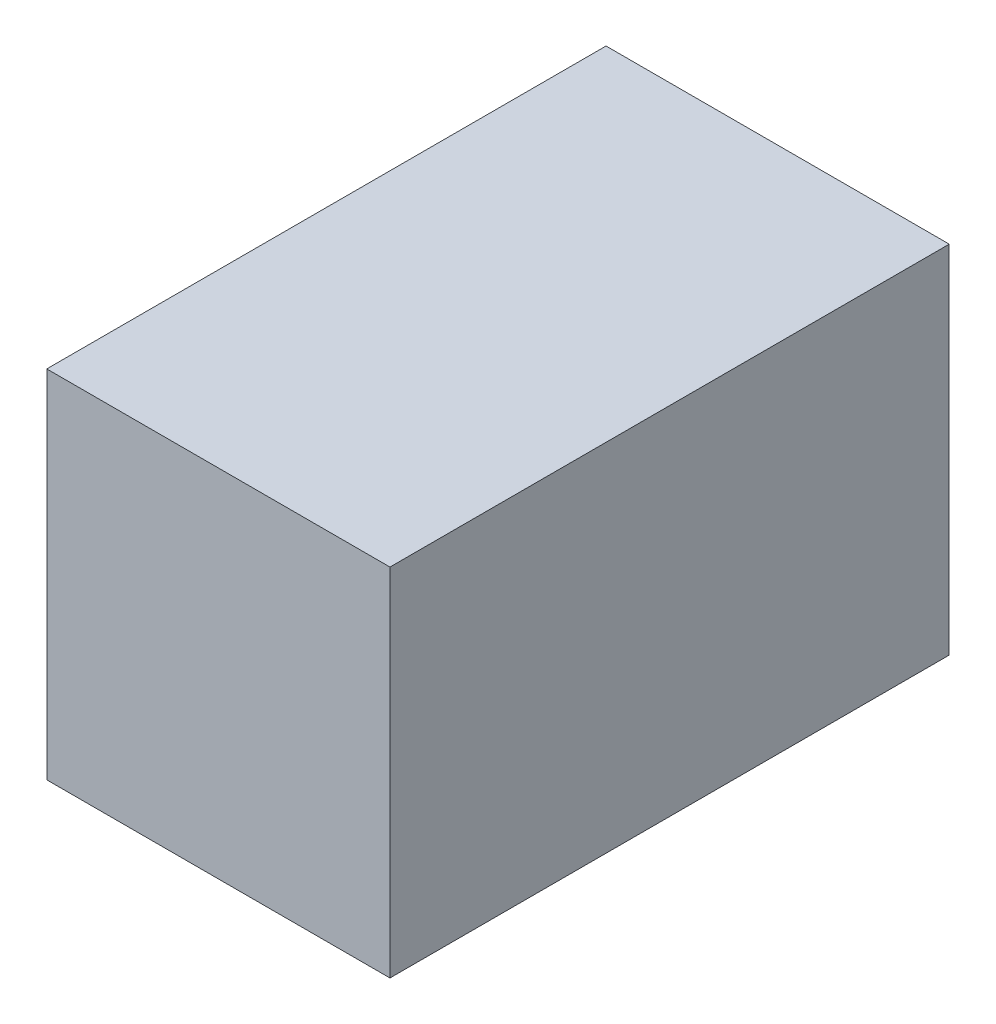
ISO-10303-21;
HEADER;
FILE_DESCRIPTION(('STEP AP214'),'2;1');
FILE_NAME('part.step','',(''),(''),'','','');
FILE_SCHEMA(('AUTOMOTIVE_DESIGN { 1 0 10303 214 1 1 1 1 }'));
ENDSEC;
DATA;
#1=APPLICATION_CONTEXT('core data for automotive mechanical design processes');
#2=APPLICATION_PROTOCOL_DEFINITION('international standard','automotive_design',2000,#1);
#3=PRODUCT_CONTEXT('',#1,'mechanical');
#4=PRODUCT('Part','Part','',(#3));
#5=PRODUCT_RELATED_PRODUCT_CATEGORY('part','',(#4));
#6=PRODUCT_DEFINITION_FORMATION('','',#4);
#7=PRODUCT_DEFINITION_CONTEXT('part definition',#1,'design');
#8=PRODUCT_DEFINITION('design','',#6,#7);
#9=PRODUCT_DEFINITION_SHAPE('','',#8);
#10=(LENGTH_UNIT() NAMED_UNIT(*) SI_UNIT(.MILLI.,.METRE.));
#11=(NAMED_UNIT(*) PLANE_ANGLE_UNIT() SI_UNIT($,.RADIAN.));
#12=(NAMED_UNIT(*) SI_UNIT($,.STERADIAN.) SOLID_ANGLE_UNIT());
#13=UNCERTAINTY_MEASURE_WITH_UNIT(LENGTH_MEASURE(1.E-05),#10,'distance_accuracy_value','');
#14=(GEOMETRIC_REPRESENTATION_CONTEXT(3) GLOBAL_UNCERTAINTY_ASSIGNED_CONTEXT((#13)) GLOBAL_UNIT_ASSIGNED_CONTEXT((#10,
#11,#12)) REPRESENTATION_CONTEXT('',''));
#15=CARTESIAN_POINT('',(0.,0.,0.));
#16=DIRECTION('',(0.,0.,1.));
#17=DIRECTION('',(1.,0.,0.));
#18=AXIS2_PLACEMENT_3D('',#15,#16,#17);
#19=CARTESIAN_POINT('',(0.,177.8,0.));
#20=DIRECTION('',(1.,0.,0.));
#21=DIRECTION('',(0.,0.,-1.));
#22=AXIS2_PLACEMENT_3D('',#19,#20,#21);
#23=PLANE('',#22);
#24=DIRECTION('',(0.,0.,1.));
#25=VECTOR('',#24,1.);
#26=CARTESIAN_POINT('',(0.,0.,0.));
#27=LINE('',#26,#25);
#28=CARTESIAN_POINT('',(0.,0.,-279.4));
#29=VERTEX_POINT('',#28);
#30=CARTESIAN_POINT('',(0.,0.,0.));
#31=VERTEX_POINT('',#30);
#32=EDGE_CURVE('E110',#29,#31,#27,.T.);
#33=ORIENTED_EDGE('',*,*,#32,.T.);
#34=DIRECTION('',(0.,-1.,0.));
#35=VECTOR('',#34,1.);
#36=CARTESIAN_POINT('',(0.,177.8,0.));
#37=LINE('',#36,#35);
#38=CARTESIAN_POINT('',(0.,177.8,0.));
#39=VERTEX_POINT('',#38);
#40=EDGE_CURVE('E11',#39,#31,#37,.T.);
#41=ORIENTED_EDGE('',*,*,#40,.F.);
#42=DIRECTION('',(0.,0.,1.));
#43=VECTOR('',#42,1.);
#44=CARTESIAN_POINT('',(0.,177.8,0.));
#45=LINE('',#44,#43);
#46=CARTESIAN_POINT('',(0.,177.8,-279.4));
#47=VERTEX_POINT('',#46);
#48=EDGE_CURVE('E94',#47,#39,#45,.T.);
#49=ORIENTED_EDGE('',*,*,#48,.F.);
#50=DIRECTION('',(0.,-1.,0.));
#51=VECTOR('',#50,1.);
#52=CARTESIAN_POINT('',(0.,177.8,-279.4));
#53=LINE('',#52,#51);
#54=EDGE_CURVE('E106',#47,#29,#53,.T.);
#55=ORIENTED_EDGE('',*,*,#54,.T.);
#56=EDGE_LOOP('',(#33,#41,#49,#55));
#57=FACE_BOUND('',#56,.T.);
#58=ADVANCED_FACE('F42',(#57),#23,.F.);
#59=CARTESIAN_POINT('',(0.,177.8,0.));
#60=DIRECTION('',(0.,0.,-1.));
#61=DIRECTION('',(-1.,0.,0.));
#62=AXIS2_PLACEMENT_3D('',#59,#60,#61);
#63=PLANE('',#62);
#64=DIRECTION('',(1.,0.,0.));
#65=VECTOR('',#64,1.);
#66=CARTESIAN_POINT('',(0.,0.,0.));
#67=LINE('',#66,#65);
#68=CARTESIAN_POINT('',(171.45,0.,0.));
#69=VERTEX_POINT('',#68);
#70=EDGE_CURVE('E99',#31,#69,#67,.T.);
#71=ORIENTED_EDGE('',*,*,#70,.T.);
#72=DIRECTION('',(0.,-1.,0.));
#73=VECTOR('',#72,1.);
#74=CARTESIAN_POINT('',(171.45,177.8,0.));
#75=LINE('',#74,#73);
#76=CARTESIAN_POINT('',(171.45,177.8,0.));
#77=VERTEX_POINT('',#76);
#78=EDGE_CURVE('E51',#77,#69,#75,.T.);
#79=ORIENTED_EDGE('',*,*,#78,.F.);
#80=DIRECTION('',(1.,0.,0.));
#81=VECTOR('',#80,1.);
#82=CARTESIAN_POINT('',(0.,177.8,0.));
#83=LINE('',#82,#81);
#84=EDGE_CURVE('E89',#39,#77,#83,.T.);
#85=ORIENTED_EDGE('',*,*,#84,.F.);
#86=ORIENTED_EDGE('',*,*,#40,.T.);
#87=EDGE_LOOP('',(#71,#79,#85,#86));
#88=FACE_BOUND('',#87,.T.);
#89=ADVANCED_FACE('F98',(#88),#63,.F.);
#90=CARTESIAN_POINT('',(171.45,177.8,0.));
#91=DIRECTION('',(-1.,0.,0.));
#92=DIRECTION('',(0.,0.,1.));
#93=AXIS2_PLACEMENT_3D('',#90,#91,#92);
#94=PLANE('',#93);
#95=DIRECTION('',(0.,0.,-1.));
#96=VECTOR('',#95,1.);
#97=CARTESIAN_POINT('',(171.45,0.,0.));
#98=LINE('',#97,#96);
#99=CARTESIAN_POINT('',(171.45,0.,-279.4));
#100=VERTEX_POINT('',#99);
#101=EDGE_CURVE('E76',#69,#100,#98,.T.);
#102=ORIENTED_EDGE('',*,*,#101,.T.);
#103=DIRECTION('',(0.,-1.,0.));
#104=VECTOR('',#103,1.);
#105=CARTESIAN_POINT('',(171.45,177.8,-279.4));
#106=LINE('',#105,#104);
#107=CARTESIAN_POINT('',(171.45,177.8,-279.4));
#108=VERTEX_POINT('',#107);
#109=EDGE_CURVE('E101',#108,#100,#106,.T.);
#110=ORIENTED_EDGE('',*,*,#109,.F.);
#111=DIRECTION('',(0.,0.,-1.));
#112=VECTOR('',#111,1.);
#113=CARTESIAN_POINT('',(171.45,177.8,0.));
#114=LINE('',#113,#112);
#115=EDGE_CURVE('E92',#77,#108,#114,.T.);
#116=ORIENTED_EDGE('',*,*,#115,.F.);
#117=ORIENTED_EDGE('',*,*,#78,.T.);
#118=EDGE_LOOP('',(#102,#110,#116,#117));
#119=FACE_BOUND('',#118,.T.);
#120=ADVANCED_FACE('F102',(#119),#94,.F.);
#121=CARTESIAN_POINT('',(0.,177.8,-279.4));
#122=DIRECTION('',(0.,0.,1.));
#123=DIRECTION('',(1.,0.,0.));
#124=AXIS2_PLACEMENT_3D('',#121,#122,#123);
#125=PLANE('',#124);
#126=DIRECTION('',(-1.,0.,0.));
#127=VECTOR('',#126,1.);
#128=CARTESIAN_POINT('',(0.,0.,-279.4));
#129=LINE('',#128,#127);
#130=EDGE_CURVE('E82',#100,#29,#129,.T.);
#131=ORIENTED_EDGE('',*,*,#130,.T.);
#132=ORIENTED_EDGE('',*,*,#54,.F.);
#133=DIRECTION('',(-1.,0.,0.));
#134=VECTOR('',#133,1.);
#135=CARTESIAN_POINT('',(0.,177.8,-279.4));
#136=LINE('',#135,#134);
#137=EDGE_CURVE('E59',#108,#47,#136,.T.);
#138=ORIENTED_EDGE('',*,*,#137,.F.);
#139=ORIENTED_EDGE('',*,*,#109,.T.);
#140=EDGE_LOOP('',(#131,#132,#138,#139));
#141=FACE_BOUND('',#140,.T.);
#142=ADVANCED_FACE('F123',(#141),#125,.F.);
#143=CARTESIAN_POINT('',(0.,177.8,0.));
#144=DIRECTION('',(0.,-1.,0.));
#145=DIRECTION('',(0.,0.,-1.));
#146=AXIS2_PLACEMENT_3D('',#143,#144,#145);
#147=PLANE('',#146);
#148=ORIENTED_EDGE('',*,*,#48,.T.);
#149=ORIENTED_EDGE('',*,*,#84,.T.);
#150=ORIENTED_EDGE('',*,*,#115,.T.);
#151=ORIENTED_EDGE('',*,*,#137,.T.);
#152=EDGE_LOOP('',(#148,#149,#150,#151));
#153=FACE_BOUND('',#152,.T.);
#154=ADVANCED_FACE('F90',(#153),#147,.F.);
#155=CARTESIAN_POINT('',(0.,0.,0.));
#156=DIRECTION('',(0.,-1.,0.));
#157=DIRECTION('',(0.,0.,-1.));
#158=AXIS2_PLACEMENT_3D('',#155,#156,#157);
#159=PLANE('',#158);
#160=ORIENTED_EDGE('',*,*,#32,.F.);
#161=ORIENTED_EDGE('',*,*,#130,.F.);
#162=ORIENTED_EDGE('',*,*,#101,.F.);
#163=ORIENTED_EDGE('',*,*,#70,.F.);
#164=EDGE_LOOP('',(#160,#161,#162,#163));
#165=FACE_BOUND('',#164,.T.);
#166=ADVANCED_FACE('F126',(#165),#159,.T.);
#167=CLOSED_SHELL('',(#58,#89,#120,#142,#154,#166));
#168=MANIFOLD_SOLID_BREP('B2',#167);
#169=ADVANCED_BREP_SHAPE_REPRESENTATION('',(#18,#168),#14);
#170=SHAPE_DEFINITION_REPRESENTATION(#9,#169);
ENDSEC;
END-ISO-10303-21;
